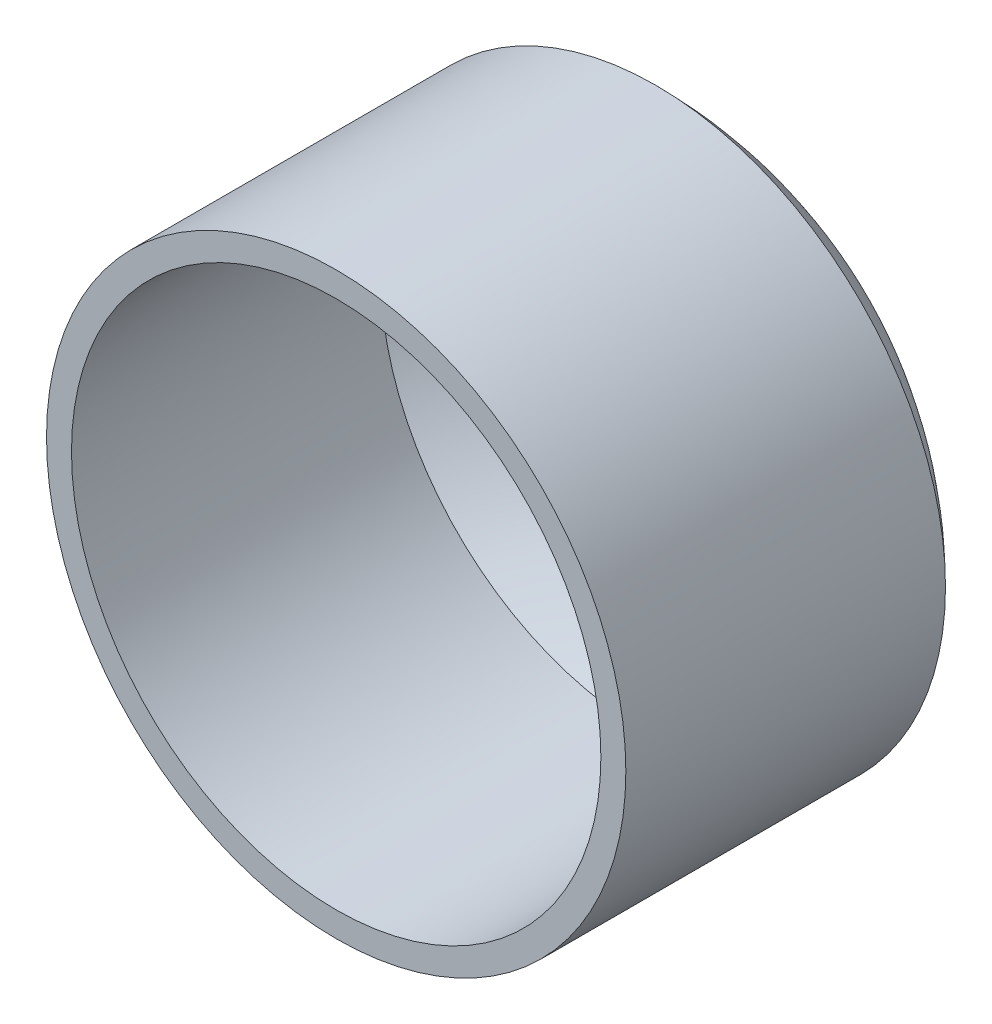
ISO-10303-21;
HEADER;
FILE_DESCRIPTION(('STEP AP214'),'2;1');
FILE_NAME('part.step','',(''),(''),'','','');
FILE_SCHEMA(('AUTOMOTIVE_DESIGN { 1 0 10303 214 1 1 1 1 }'));
ENDSEC;
DATA;
#1=APPLICATION_CONTEXT('core data for automotive mechanical design processes');
#2=APPLICATION_PROTOCOL_DEFINITION('international standard','automotive_design',2000,#1);
#3=PRODUCT_CONTEXT('',#1,'mechanical');
#4=PRODUCT('Part','Part','',(#3));
#5=PRODUCT_RELATED_PRODUCT_CATEGORY('part','',(#4));
#6=PRODUCT_DEFINITION_FORMATION('','',#4);
#7=PRODUCT_DEFINITION_CONTEXT('part definition',#1,'design');
#8=PRODUCT_DEFINITION('design','',#6,#7);
#9=PRODUCT_DEFINITION_SHAPE('','',#8);
#10=(LENGTH_UNIT() NAMED_UNIT(*) SI_UNIT(.MILLI.,.METRE.));
#11=(NAMED_UNIT(*) PLANE_ANGLE_UNIT() SI_UNIT($,.RADIAN.));
#12=(NAMED_UNIT(*) SI_UNIT($,.STERADIAN.) SOLID_ANGLE_UNIT());
#13=UNCERTAINTY_MEASURE_WITH_UNIT(LENGTH_MEASURE(1.E-05),#10,'distance_accuracy_value','');
#14=(GEOMETRIC_REPRESENTATION_CONTEXT(3) GLOBAL_UNCERTAINTY_ASSIGNED_CONTEXT((#13)) GLOBAL_UNIT_ASSIGNED_CONTEXT((#10,
#11,#12)) REPRESENTATION_CONTEXT('',''));
#15=CARTESIAN_POINT('',(0.,0.,0.));
#16=DIRECTION('',(0.,0.,1.));
#17=DIRECTION('',(1.,0.,0.));
#18=AXIS2_PLACEMENT_3D('',#15,#16,#17);
#19=CARTESIAN_POINT('',(0.,0.,101.6));
#20=DIRECTION('',(0.,0.,-1.));
#21=DIRECTION('',(-1.,0.,0.));
#22=AXIS2_PLACEMENT_3D('',#19,#20,#21);
#23=CYLINDRICAL_SURFACE('',#22,92.075);
#24=CARTESIAN_POINT('',(0.,0.,101.6));
#25=DIRECTION('',(0.,0.,1.));
#26=DIRECTION('',(1.,0.,0.));
#27=AXIS2_PLACEMENT_3D('',#24,#25,#26);
#28=CIRCLE('',#27,92.075);
#29=CARTESIAN_POINT('',(92.075,0.,101.6));
#30=VERTEX_POINT('',#29);
#31=EDGE_CURVE('E10',#30,#30,#28,.T.);
#32=ORIENTED_EDGE('',*,*,#31,.F.);
#33=EDGE_LOOP('',(#32));
#34=FACE_BOUND('',#33,.T.);
#35=CARTESIAN_POINT('',(0.,0.,0.));
#36=DIRECTION('',(0.,0.,1.));
#37=DIRECTION('',(1.,0.,0.));
#38=AXIS2_PLACEMENT_3D('',#35,#36,#37);
#39=CIRCLE('',#38,92.075);
#40=CARTESIAN_POINT('',(92.075,0.,0.));
#41=VERTEX_POINT('',#40);
#42=EDGE_CURVE('E44',#41,#41,#39,.T.);
#43=ORIENTED_EDGE('',*,*,#42,.T.);
#44=EDGE_LOOP('',(#43));
#45=FACE_BOUND('',#44,.T.);
#46=ADVANCED_FACE('F38',(#34,#45),#23,.T.);
#47=CARTESIAN_POINT('',(0.,0.,101.6));
#48=DIRECTION('',(0.,0.,1.));
#49=DIRECTION('',(1.,0.,0.));
#50=AXIS2_PLACEMENT_3D('',#47,#48,#49);
#51=PLANE('',#50);
#52=CARTESIAN_POINT('',(0.,0.,101.6));
#53=DIRECTION('',(0.,0.,1.));
#54=DIRECTION('',(1.,0.,0.));
#55=AXIS2_PLACEMENT_3D('',#52,#53,#54);
#56=CIRCLE('',#55,84.1375);
#57=CARTESIAN_POINT('',(84.1375,0.,101.6));
#58=VERTEX_POINT('',#57);
#59=EDGE_CURVE('E48',#58,#58,#56,.T.);
#60=ORIENTED_EDGE('',*,*,#59,.F.);
#61=EDGE_LOOP('',(#60));
#62=FACE_BOUND('',#61,.T.);
#63=ORIENTED_EDGE('',*,*,#31,.T.);
#64=EDGE_LOOP('',(#63));
#65=FACE_BOUND('',#64,.T.);
#66=ADVANCED_FACE('F70',(#62,#65),#51,.T.);
#67=CARTESIAN_POINT('',(0.,0.,92.2072916666666));
#68=DIRECTION('',(0.,0.,1.));
#69=DIRECTION('',(0.,1.,0.));
#70=AXIS2_PLACEMENT_3D('',#67,#68,#69);
#71=SPHERICAL_SURFACE('',#70,130.307291666667);
#72=ORIENTED_EDGE('',*,*,#42,.F.);
#73=EDGE_LOOP('',(#72));
#74=FACE_BOUND('',#73,.T.);
#75=ADVANCED_FACE('F62',(#74),#71,.T.);
#76=CARTESIAN_POINT('',(0.,0.,101.6));
#77=DIRECTION('',(0.,0.,-1.));
#78=DIRECTION('',(-1.,0.,0.));
#79=AXIS2_PLACEMENT_3D('',#76,#77,#78);
#80=CYLINDRICAL_SURFACE('',#79,84.1375);
#81=ORIENTED_EDGE('',*,*,#59,.T.);
#82=EDGE_LOOP('',(#81));
#83=FACE_BOUND('',#82,.T.);
#84=CARTESIAN_POINT('',(0.,0.,3.35208919492951));
#85=DIRECTION('',(0.,0.,1.));
#86=DIRECTION('',(1.,0.,0.));
#87=AXIS2_PLACEMENT_3D('',#84,#85,#86);
#88=CIRCLE('',#87,84.1375);
#89=CARTESIAN_POINT('',(84.1375,0.,3.35208919492951));
#90=VERTEX_POINT('',#89);
#91=EDGE_CURVE('E52',#90,#90,#88,.T.);
#92=ORIENTED_EDGE('',*,*,#91,.F.);
#93=EDGE_LOOP('',(#92));
#94=FACE_BOUND('',#93,.T.);
#95=ADVANCED_FACE('F60',(#83,#94),#80,.F.);
#96=CARTESIAN_POINT('',(0.,0.,92.2072916666666));
#97=DIRECTION('',(0.,0.,1.));
#98=DIRECTION('',(0.,1.,0.));
#99=AXIS2_PLACEMENT_3D('',#96,#97,#98);
#100=SPHERICAL_SURFACE('',#99,122.369791666667);
#101=ORIENTED_EDGE('',*,*,#91,.T.);
#102=EDGE_LOOP('',(#101));
#103=FACE_BOUND('',#102,.T.);
#104=ADVANCED_FACE('F58',(#103),#100,.F.);
#105=CLOSED_SHELL('',(#46,#66,#75,#95,#104));
#106=MANIFOLD_SOLID_BREP('B2',#105);
#107=ADVANCED_BREP_SHAPE_REPRESENTATION('',(#18,#106),#14);
#108=SHAPE_DEFINITION_REPRESENTATION(#9,#107);
ENDSEC;
END-ISO-10303-21;
